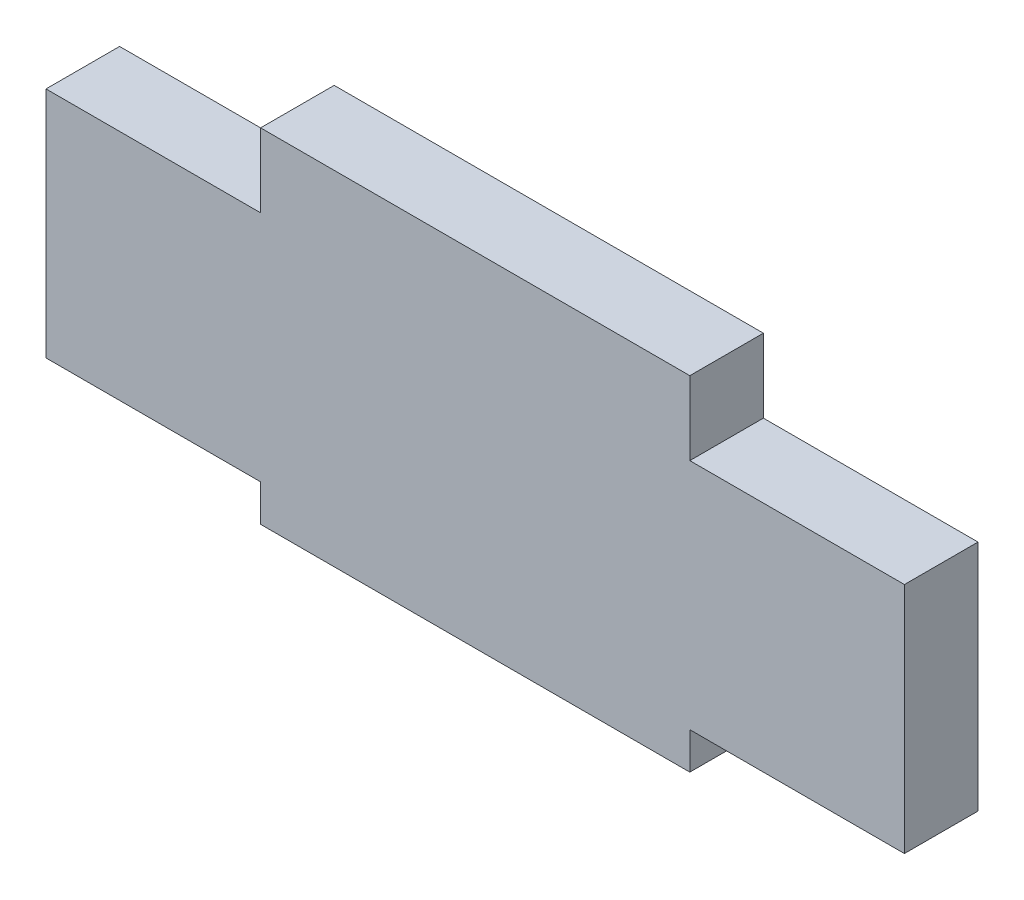
ISO-10303-21;
HEADER;
FILE_DESCRIPTION(('STEP AP214'),'2;1');
FILE_NAME('part.step','',(''),(''),'','','');
FILE_SCHEMA(('AUTOMOTIVE_DESIGN { 1 0 10303 214 1 1 1 1 }'));
ENDSEC;
DATA;
#1=APPLICATION_CONTEXT('core data for automotive mechanical design processes');
#2=APPLICATION_PROTOCOL_DEFINITION('international standard','automotive_design',2000,#1);
#3=PRODUCT_CONTEXT('',#1,'mechanical');
#4=PRODUCT('Part','Part','',(#3));
#5=PRODUCT_RELATED_PRODUCT_CATEGORY('part','',(#4));
#6=PRODUCT_DEFINITION_FORMATION('','',#4);
#7=PRODUCT_DEFINITION_CONTEXT('part definition',#1,'design');
#8=PRODUCT_DEFINITION('design','',#6,#7);
#9=PRODUCT_DEFINITION_SHAPE('','',#8);
#10=(LENGTH_UNIT() NAMED_UNIT(*) SI_UNIT(.MILLI.,.METRE.));
#11=(NAMED_UNIT(*) PLANE_ANGLE_UNIT() SI_UNIT($,.RADIAN.));
#12=(NAMED_UNIT(*) SI_UNIT($,.STERADIAN.) SOLID_ANGLE_UNIT());
#13=UNCERTAINTY_MEASURE_WITH_UNIT(LENGTH_MEASURE(1.E-05),#10,'distance_accuracy_value','');
#14=(GEOMETRIC_REPRESENTATION_CONTEXT(3) GLOBAL_UNCERTAINTY_ASSIGNED_CONTEXT((#13)) GLOBAL_UNIT_ASSIGNED_CONTEXT((#10,
#11,#12)) REPRESENTATION_CONTEXT('',''));
#15=CARTESIAN_POINT('',(0.,0.,0.));
#16=DIRECTION('',(0.,0.,1.));
#17=DIRECTION('',(1.,0.,0.));
#18=AXIS2_PLACEMENT_3D('',#15,#16,#17);
#19=CARTESIAN_POINT('',(0.,-9.5,6.));
#20=DIRECTION('',(0.,1.,0.));
#21=DIRECTION('',(0.,0.,1.));
#22=AXIS2_PLACEMENT_3D('',#19,#20,#21);
#23=PLANE('',#22);
#24=DIRECTION('',(1.,0.,0.));
#25=VECTOR('',#24,1.);
#26=CARTESIAN_POINT('',(0.,-9.5,0.));
#27=LINE('',#26,#25);
#28=CARTESIAN_POINT('',(-35.,-9.5,0.));
#29=VERTEX_POINT('',#28);
#30=CARTESIAN_POINT('',(-17.5,-9.5,0.));
#31=VERTEX_POINT('',#30);
#32=EDGE_CURVE('E218',#29,#31,#27,.T.);
#33=ORIENTED_EDGE('',*,*,#32,.T.);
#34=DIRECTION('',(0.,0.,-1.));
#35=VECTOR('',#34,1.);
#36=CARTESIAN_POINT('',(-17.5,-9.5,6.));
#37=LINE('',#36,#35);
#38=CARTESIAN_POINT('',(-17.5,-9.5,6.));
#39=VERTEX_POINT('',#38);
#40=EDGE_CURVE('E11',#39,#31,#37,.T.);
#41=ORIENTED_EDGE('',*,*,#40,.F.);
#42=DIRECTION('',(1.,0.,0.));
#43=VECTOR('',#42,1.);
#44=CARTESIAN_POINT('',(0.,-9.5,6.));
#45=LINE('',#44,#43);
#46=CARTESIAN_POINT('',(-35.,-9.5,6.));
#47=VERTEX_POINT('',#46);
#48=EDGE_CURVE('E170',#47,#39,#45,.T.);
#49=ORIENTED_EDGE('',*,*,#48,.F.);
#50=DIRECTION('',(0.,0.,-1.));
#51=VECTOR('',#50,1.);
#52=CARTESIAN_POINT('',(-35.,-9.5,6.));
#53=LINE('',#52,#51);
#54=EDGE_CURVE('E52',#47,#29,#53,.T.);
#55=ORIENTED_EDGE('',*,*,#54,.T.);
#56=EDGE_LOOP('',(#33,#41,#49,#55));
#57=FACE_BOUND('',#56,.T.);
#58=ADVANCED_FACE('F35',(#57),#23,.F.);
#59=CARTESIAN_POINT('',(-17.5,0.,6.));
#60=DIRECTION('',(1.,0.,0.));
#61=DIRECTION('',(0.,0.,-1.));
#62=AXIS2_PLACEMENT_3D('',#59,#60,#61);
#63=PLANE('',#62);
#64=DIRECTION('',(0.,-1.,0.));
#65=VECTOR('',#64,1.);
#66=CARTESIAN_POINT('',(-17.5,0.,0.));
#67=LINE('',#66,#65);
#68=CARTESIAN_POINT('',(-17.5,-12.5,0.));
#69=VERTEX_POINT('',#68);
#70=EDGE_CURVE('E212',#31,#69,#67,.T.);
#71=ORIENTED_EDGE('',*,*,#70,.T.);
#72=DIRECTION('',(0.,0.,-1.));
#73=VECTOR('',#72,1.);
#74=CARTESIAN_POINT('',(-17.5,-12.5,6.));
#75=LINE('',#74,#73);
#76=CARTESIAN_POINT('',(-17.5,-12.5,6.));
#77=VERTEX_POINT('',#76);
#78=EDGE_CURVE('E44',#77,#69,#75,.T.);
#79=ORIENTED_EDGE('',*,*,#78,.F.);
#80=DIRECTION('',(0.,-1.,0.));
#81=VECTOR('',#80,1.);
#82=CARTESIAN_POINT('',(-17.5,0.,6.));
#83=LINE('',#82,#81);
#84=EDGE_CURVE('E102',#39,#77,#83,.T.);
#85=ORIENTED_EDGE('',*,*,#84,.F.);
#86=ORIENTED_EDGE('',*,*,#40,.T.);
#87=EDGE_LOOP('',(#71,#79,#85,#86));
#88=FACE_BOUND('',#87,.T.);
#89=ADVANCED_FACE('F37',(#88),#63,.F.);
#90=CARTESIAN_POINT('',(0.,-12.5,6.));
#91=DIRECTION('',(0.,1.,0.));
#92=DIRECTION('',(0.,0.,1.));
#93=AXIS2_PLACEMENT_3D('',#90,#91,#92);
#94=PLANE('',#93);
#95=DIRECTION('',(1.,0.,0.));
#96=VECTOR('',#95,1.);
#97=CARTESIAN_POINT('',(0.,-12.5,0.));
#98=LINE('',#97,#96);
#99=CARTESIAN_POINT('',(17.5,-12.5,0.));
#100=VERTEX_POINT('',#99);
#101=EDGE_CURVE('E209',#69,#100,#98,.T.);
#102=ORIENTED_EDGE('',*,*,#101,.T.);
#103=DIRECTION('',(0.,0.,-1.));
#104=VECTOR('',#103,1.);
#105=CARTESIAN_POINT('',(17.5,-12.5,6.));
#106=LINE('',#105,#104);
#107=CARTESIAN_POINT('',(17.5,-12.5,6.));
#108=VERTEX_POINT('',#107);
#109=EDGE_CURVE('E201',#108,#100,#106,.T.);
#110=ORIENTED_EDGE('',*,*,#109,.F.);
#111=DIRECTION('',(1.,0.,0.));
#112=VECTOR('',#111,1.);
#113=CARTESIAN_POINT('',(0.,-12.5,6.));
#114=LINE('',#113,#112);
#115=EDGE_CURVE('E173',#77,#108,#114,.T.);
#116=ORIENTED_EDGE('',*,*,#115,.F.);
#117=ORIENTED_EDGE('',*,*,#78,.T.);
#118=EDGE_LOOP('',(#102,#110,#116,#117));
#119=FACE_BOUND('',#118,.T.);
#120=ADVANCED_FACE('F207',(#119),#94,.F.);
#121=CARTESIAN_POINT('',(17.5,0.,6.));
#122=DIRECTION('',(-1.,0.,0.));
#123=DIRECTION('',(0.,0.,1.));
#124=AXIS2_PLACEMENT_3D('',#121,#122,#123);
#125=PLANE('',#124);
#126=DIRECTION('',(0.,1.,0.));
#127=VECTOR('',#126,1.);
#128=CARTESIAN_POINT('',(17.5,0.,0.));
#129=LINE('',#128,#127);
#130=CARTESIAN_POINT('',(17.5,-9.5,0.));
#131=VERTEX_POINT('',#130);
#132=EDGE_CURVE('E214',#100,#131,#129,.T.);
#133=ORIENTED_EDGE('',*,*,#132,.T.);
#134=DIRECTION('',(0.,0.,-1.));
#135=VECTOR('',#134,1.);
#136=CARTESIAN_POINT('',(17.5,-9.5,6.));
#137=LINE('',#136,#135);
#138=CARTESIAN_POINT('',(17.5,-9.5,6.));
#139=VERTEX_POINT('',#138);
#140=EDGE_CURVE('E198',#139,#131,#137,.T.);
#141=ORIENTED_EDGE('',*,*,#140,.F.);
#142=DIRECTION('',(0.,1.,0.));
#143=VECTOR('',#142,1.);
#144=CARTESIAN_POINT('',(17.5,0.,6.));
#145=LINE('',#144,#143);
#146=EDGE_CURVE('E168',#108,#139,#145,.T.);
#147=ORIENTED_EDGE('',*,*,#146,.F.);
#148=ORIENTED_EDGE('',*,*,#109,.T.);
#149=EDGE_LOOP('',(#133,#141,#147,#148));
#150=FACE_BOUND('',#149,.T.);
#151=ADVANCED_FACE('F263',(#150),#125,.F.);
#152=CARTESIAN_POINT('',(35.,-9.5,0.));
#153=VERTEX_POINT('',#152);
#154=EDGE_CURVE('E216',#131,#153,#27,.T.);
#155=ORIENTED_EDGE('',*,*,#154,.T.);
#156=DIRECTION('',(0.,0.,-1.));
#157=VECTOR('',#156,1.);
#158=CARTESIAN_POINT('',(35.,-9.5,6.));
#159=LINE('',#158,#157);
#160=CARTESIAN_POINT('',(35.,-9.5,6.));
#161=VERTEX_POINT('',#160);
#162=EDGE_CURVE('E195',#161,#153,#159,.T.);
#163=ORIENTED_EDGE('',*,*,#162,.F.);
#164=EDGE_CURVE('E165',#139,#161,#45,.T.);
#165=ORIENTED_EDGE('',*,*,#164,.F.);
#166=ORIENTED_EDGE('',*,*,#140,.T.);
#167=EDGE_LOOP('',(#155,#163,#165,#166));
#168=FACE_BOUND('',#167,.T.);
#169=ADVANCED_FACE('F243',(#168),#23,.F.);
#170=CARTESIAN_POINT('',(35.,0.,6.));
#171=DIRECTION('',(-1.,0.,0.));
#172=DIRECTION('',(0.,0.,1.));
#173=AXIS2_PLACEMENT_3D('',#170,#171,#172);
#174=PLANE('',#173);
#175=DIRECTION('',(0.,1.,0.));
#176=VECTOR('',#175,1.);
#177=CARTESIAN_POINT('',(35.,0.,0.));
#178=LINE('',#177,#176);
#179=CARTESIAN_POINT('',(35.,9.5,0.));
#180=VERTEX_POINT('',#179);
#181=EDGE_CURVE('E222',#153,#180,#178,.T.);
#182=ORIENTED_EDGE('',*,*,#181,.T.);
#183=DIRECTION('',(0.,0.,-1.));
#184=VECTOR('',#183,1.);
#185=CARTESIAN_POINT('',(35.,9.5,6.));
#186=LINE('',#185,#184);
#187=CARTESIAN_POINT('',(35.,9.5,6.));
#188=VERTEX_POINT('',#187);
#189=EDGE_CURVE('E193',#188,#180,#186,.T.);
#190=ORIENTED_EDGE('',*,*,#189,.F.);
#191=DIRECTION('',(0.,1.,0.));
#192=VECTOR('',#191,1.);
#193=CARTESIAN_POINT('',(35.,0.,6.));
#194=LINE('',#193,#192);
#195=EDGE_CURVE('E161',#161,#188,#194,.T.);
#196=ORIENTED_EDGE('',*,*,#195,.F.);
#197=ORIENTED_EDGE('',*,*,#162,.T.);
#198=EDGE_LOOP('',(#182,#190,#196,#197));
#199=FACE_BOUND('',#198,.T.);
#200=ADVANCED_FACE('F239',(#199),#174,.F.);
#201=CARTESIAN_POINT('',(0.,9.5,6.));
#202=DIRECTION('',(0.,1.,0.));
#203=DIRECTION('',(0.,0.,1.));
#204=AXIS2_PLACEMENT_3D('',#201,#202,#203);
#205=PLANE('',#204);
#206=DIRECTION('',(1.,0.,0.));
#207=VECTOR('',#206,1.);
#208=CARTESIAN_POINT('',(0.,9.5,0.));
#209=LINE('',#208,#207);
#210=CARTESIAN_POINT('',(17.5,9.5,0.));
#211=VERTEX_POINT('',#210);
#212=EDGE_CURVE('E182',#211,#180,#209,.T.);
#213=ORIENTED_EDGE('',*,*,#212,.F.);
#214=DIRECTION('',(0.,0.,-1.));
#215=VECTOR('',#214,1.);
#216=CARTESIAN_POINT('',(17.5,9.5,6.));
#217=LINE('',#216,#215);
#218=CARTESIAN_POINT('',(17.5,9.5,6.));
#219=VERTEX_POINT('',#218);
#220=EDGE_CURVE('E191',#219,#211,#217,.T.);
#221=ORIENTED_EDGE('',*,*,#220,.F.);
#222=DIRECTION('',(1.,0.,0.));
#223=VECTOR('',#222,1.);
#224=CARTESIAN_POINT('',(0.,9.5,6.));
#225=LINE('',#224,#223);
#226=EDGE_CURVE('E155',#219,#188,#225,.T.);
#227=ORIENTED_EDGE('',*,*,#226,.T.);
#228=ORIENTED_EDGE('',*,*,#189,.T.);
#229=EDGE_LOOP('',(#213,#221,#227,#228));
#230=FACE_BOUND('',#229,.T.);
#231=ADVANCED_FACE('F236',(#230),#205,.T.);
#232=CARTESIAN_POINT('',(17.5,0.,6.));
#233=DIRECTION('',(1.,0.,0.));
#234=DIRECTION('',(0.,0.,-1.));
#235=AXIS2_PLACEMENT_3D('',#232,#233,#234);
#236=PLANE('',#235);
#237=DIRECTION('',(0.,-1.,0.));
#238=VECTOR('',#237,1.);
#239=CARTESIAN_POINT('',(17.5,0.,0.));
#240=LINE('',#239,#238);
#241=CARTESIAN_POINT('',(17.5,15.5,0.));
#242=VERTEX_POINT('',#241);
#243=EDGE_CURVE('E226',#242,#211,#240,.T.);
#244=ORIENTED_EDGE('',*,*,#243,.F.);
#245=DIRECTION('',(0.,0.,-1.));
#246=VECTOR('',#245,1.);
#247=CARTESIAN_POINT('',(17.5,15.5,6.));
#248=LINE('',#247,#246);
#249=CARTESIAN_POINT('',(17.5,15.5,6.));
#250=VERTEX_POINT('',#249);
#251=EDGE_CURVE('E189',#250,#242,#248,.T.);
#252=ORIENTED_EDGE('',*,*,#251,.F.);
#253=DIRECTION('',(0.,-1.,0.));
#254=VECTOR('',#253,1.);
#255=CARTESIAN_POINT('',(17.5,0.,6.));
#256=LINE('',#255,#254);
#257=EDGE_CURVE('E160',#250,#219,#256,.T.);
#258=ORIENTED_EDGE('',*,*,#257,.T.);
#259=ORIENTED_EDGE('',*,*,#220,.T.);
#260=EDGE_LOOP('',(#244,#252,#258,#259));
#261=FACE_BOUND('',#260,.T.);
#262=ADVANCED_FACE('F234',(#261),#236,.T.);
#263=CARTESIAN_POINT('',(0.,15.5,6.));
#264=DIRECTION('',(0.,-1.,0.));
#265=DIRECTION('',(1.,0.,0.));
#266=AXIS2_PLACEMENT_3D('',#263,#264,#265);
#267=PLANE('',#266);
#268=DIRECTION('',(-1.,0.,0.));
#269=VECTOR('',#268,1.);
#270=CARTESIAN_POINT('',(0.,15.5,0.));
#271=LINE('',#270,#269);
#272=CARTESIAN_POINT('',(-17.5,15.5,0.));
#273=VERTEX_POINT('',#272);
#274=EDGE_CURVE('E228',#242,#273,#271,.T.);
#275=ORIENTED_EDGE('',*,*,#274,.T.);
#276=DIRECTION('',(0.,0.,-1.));
#277=VECTOR('',#276,1.);
#278=CARTESIAN_POINT('',(-17.5,15.5,6.));
#279=LINE('',#278,#277);
#280=CARTESIAN_POINT('',(-17.5,15.5,6.));
#281=VERTEX_POINT('',#280);
#282=EDGE_CURVE('E150',#281,#273,#279,.T.);
#283=ORIENTED_EDGE('',*,*,#282,.F.);
#284=DIRECTION('',(-1.,0.,0.));
#285=VECTOR('',#284,1.);
#286=CARTESIAN_POINT('',(0.,15.5,6.));
#287=LINE('',#286,#285);
#288=EDGE_CURVE('E138',#250,#281,#287,.T.);
#289=ORIENTED_EDGE('',*,*,#288,.F.);
#290=ORIENTED_EDGE('',*,*,#251,.T.);
#291=EDGE_LOOP('',(#275,#283,#289,#290));
#292=FACE_BOUND('',#291,.T.);
#293=ADVANCED_FACE('F231',(#292),#267,.F.);
#294=CARTESIAN_POINT('',(-17.5,0.,6.));
#295=DIRECTION('',(1.,0.,0.));
#296=DIRECTION('',(0.,0.,-1.));
#297=AXIS2_PLACEMENT_3D('',#294,#295,#296);
#298=PLANE('',#297);
#299=DIRECTION('',(0.,-1.,0.));
#300=VECTOR('',#299,1.);
#301=CARTESIAN_POINT('',(-17.5,0.,0.));
#302=LINE('',#301,#300);
#303=CARTESIAN_POINT('',(-17.5,9.5,0.));
#304=VERTEX_POINT('',#303);
#305=EDGE_CURVE('E147',#273,#304,#302,.T.);
#306=ORIENTED_EDGE('',*,*,#305,.T.);
#307=DIRECTION('',(0.,0.,-1.));
#308=VECTOR('',#307,1.);
#309=CARTESIAN_POINT('',(-17.5,9.5,6.));
#310=LINE('',#309,#308);
#311=CARTESIAN_POINT('',(-17.5,9.5,6.));
#312=VERTEX_POINT('',#311);
#313=EDGE_CURVE('E144',#312,#304,#310,.T.);
#314=ORIENTED_EDGE('',*,*,#313,.F.);
#315=DIRECTION('',(0.,-1.,0.));
#316=VECTOR('',#315,1.);
#317=CARTESIAN_POINT('',(-17.5,0.,6.));
#318=LINE('',#317,#316);
#319=EDGE_CURVE('E130',#281,#312,#318,.T.);
#320=ORIENTED_EDGE('',*,*,#319,.F.);
#321=ORIENTED_EDGE('',*,*,#282,.T.);
#322=EDGE_LOOP('',(#306,#314,#320,#321));
#323=FACE_BOUND('',#322,.T.);
#324=ADVANCED_FACE('F145',(#323),#298,.F.);
#325=CARTESIAN_POINT('',(-35.,9.5,0.));
#326=VERTEX_POINT('',#325);
#327=EDGE_CURVE('E178',#326,#304,#209,.T.);
#328=ORIENTED_EDGE('',*,*,#327,.F.);
#329=DIRECTION('',(0.,0.,-1.));
#330=VECTOR('',#329,1.);
#331=CARTESIAN_POINT('',(-35.,9.5,6.));
#332=LINE('',#331,#330);
#333=CARTESIAN_POINT('',(-35.,9.5,6.));
#334=VERTEX_POINT('',#333);
#335=EDGE_CURVE('E90',#334,#326,#332,.T.);
#336=ORIENTED_EDGE('',*,*,#335,.F.);
#337=EDGE_CURVE('E135',#334,#312,#225,.T.);
#338=ORIENTED_EDGE('',*,*,#337,.T.);
#339=ORIENTED_EDGE('',*,*,#313,.T.);
#340=EDGE_LOOP('',(#328,#336,#338,#339));
#341=FACE_BOUND('',#340,.T.);
#342=ADVANCED_FACE('F152',(#341),#205,.T.);
#343=CARTESIAN_POINT('',(-35.,0.,6.));
#344=DIRECTION('',(-1.,0.,0.));
#345=DIRECTION('',(0.,0.,1.));
#346=AXIS2_PLACEMENT_3D('',#343,#344,#345);
#347=PLANE('',#346);
#348=DIRECTION('',(0.,1.,0.));
#349=VECTOR('',#348,1.);
#350=CARTESIAN_POINT('',(-35.,0.,0.));
#351=LINE('',#350,#349);
#352=EDGE_CURVE('E175',#29,#326,#351,.T.);
#353=ORIENTED_EDGE('',*,*,#352,.F.);
#354=ORIENTED_EDGE('',*,*,#54,.F.);
#355=DIRECTION('',(0.,1.,0.));
#356=VECTOR('',#355,1.);
#357=CARTESIAN_POINT('',(-35.,0.,6.));
#358=LINE('',#357,#356);
#359=EDGE_CURVE('E153',#47,#334,#358,.T.);
#360=ORIENTED_EDGE('',*,*,#359,.T.);
#361=ORIENTED_EDGE('',*,*,#335,.T.);
#362=EDGE_LOOP('',(#353,#354,#360,#361));
#363=FACE_BOUND('',#362,.T.);
#364=ADVANCED_FACE('F245',(#363),#347,.T.);
#365=CARTESIAN_POINT('',(0.,0.,6.));
#366=DIRECTION('',(0.,0.,1.));
#367=DIRECTION('',(1.,0.,0.));
#368=AXIS2_PLACEMENT_3D('',#365,#366,#367);
#369=PLANE('',#368);
#370=ORIENTED_EDGE('',*,*,#48,.T.);
#371=ORIENTED_EDGE('',*,*,#84,.T.);
#372=ORIENTED_EDGE('',*,*,#115,.T.);
#373=ORIENTED_EDGE('',*,*,#146,.T.);
#374=ORIENTED_EDGE('',*,*,#164,.T.);
#375=ORIENTED_EDGE('',*,*,#195,.T.);
#376=ORIENTED_EDGE('',*,*,#226,.F.);
#377=ORIENTED_EDGE('',*,*,#257,.F.);
#378=ORIENTED_EDGE('',*,*,#288,.T.);
#379=ORIENTED_EDGE('',*,*,#319,.T.);
#380=ORIENTED_EDGE('',*,*,#337,.F.);
#381=ORIENTED_EDGE('',*,*,#359,.F.);
#382=EDGE_LOOP('',(#370,#371,#372,#373,#374,#375,#376,#377,#378,#379,#380,#381));
#383=FACE_BOUND('',#382,.T.);
#384=ADVANCED_FACE('F132',(#383),#369,.T.);
#385=CARTESIAN_POINT('',(0.,0.,0.));
#386=DIRECTION('',(0.,0.,1.));
#387=DIRECTION('',(1.,0.,0.));
#388=AXIS2_PLACEMENT_3D('',#385,#386,#387);
#389=PLANE('',#388);
#390=ORIENTED_EDGE('',*,*,#32,.F.);
#391=ORIENTED_EDGE('',*,*,#352,.T.);
#392=ORIENTED_EDGE('',*,*,#327,.T.);
#393=ORIENTED_EDGE('',*,*,#305,.F.);
#394=ORIENTED_EDGE('',*,*,#274,.F.);
#395=ORIENTED_EDGE('',*,*,#243,.T.);
#396=ORIENTED_EDGE('',*,*,#212,.T.);
#397=ORIENTED_EDGE('',*,*,#181,.F.);
#398=ORIENTED_EDGE('',*,*,#154,.F.);
#399=ORIENTED_EDGE('',*,*,#132,.F.);
#400=ORIENTED_EDGE('',*,*,#101,.F.);
#401=ORIENTED_EDGE('',*,*,#70,.F.);
#402=EDGE_LOOP('',(#390,#391,#392,#393,#394,#395,#396,#397,#398,#399,#400,#401));
#403=FACE_BOUND('',#402,.T.);
#404=ADVANCED_FACE('F211',(#403),#389,.F.);
#405=CLOSED_SHELL('',(#58,#89,#120,#151,#169,#200,#231,#262,#293,#324,#342,#364,#384,#404));
#406=MANIFOLD_SOLID_BREP('B2',#405);
#407=ADVANCED_BREP_SHAPE_REPRESENTATION('',(#18,#406),#14);
#408=SHAPE_DEFINITION_REPRESENTATION(#9,#407);
ENDSEC;
END-ISO-10303-21;
